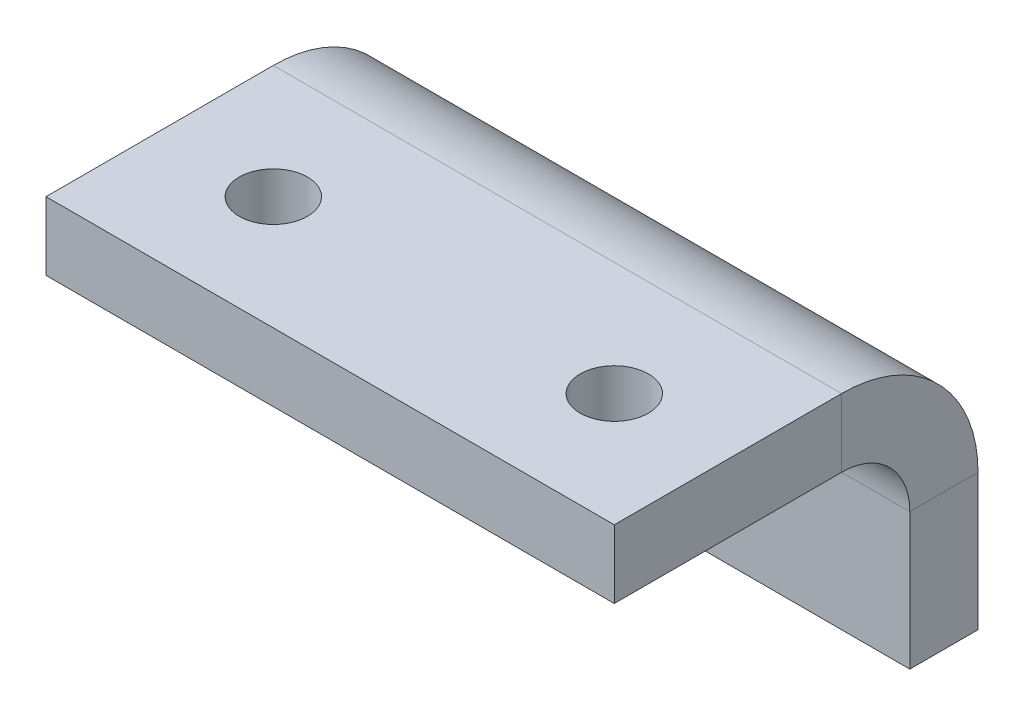
ISO-10303-21;
HEADER;
FILE_DESCRIPTION(('STEP AP214'),'2;1');
FILE_NAME('part.step','',(''),(''),'','','');
FILE_SCHEMA(('AUTOMOTIVE_DESIGN { 1 0 10303 214 1 1 1 1 }'));
ENDSEC;
DATA;
#1=APPLICATION_CONTEXT('core data for automotive mechanical design processes');
#2=APPLICATION_PROTOCOL_DEFINITION('international standard','automotive_design',2000,#1);
#3=PRODUCT_CONTEXT('',#1,'mechanical');
#4=PRODUCT('Part','Part','',(#3));
#5=PRODUCT_RELATED_PRODUCT_CATEGORY('part','',(#4));
#6=PRODUCT_DEFINITION_FORMATION('','',#4);
#7=PRODUCT_DEFINITION_CONTEXT('part definition',#1,'design');
#8=PRODUCT_DEFINITION('design','',#6,#7);
#9=PRODUCT_DEFINITION_SHAPE('','',#8);
#10=(LENGTH_UNIT() NAMED_UNIT(*) SI_UNIT(.MILLI.,.METRE.));
#11=(NAMED_UNIT(*) PLANE_ANGLE_UNIT() SI_UNIT($,.RADIAN.));
#12=(NAMED_UNIT(*) SI_UNIT($,.STERADIAN.) SOLID_ANGLE_UNIT());
#13=UNCERTAINTY_MEASURE_WITH_UNIT(LENGTH_MEASURE(1.E-05),#10,'distance_accuracy_value','');
#14=(GEOMETRIC_REPRESENTATION_CONTEXT(3) GLOBAL_UNCERTAINTY_ASSIGNED_CONTEXT((#13)) GLOBAL_UNIT_ASSIGNED_CONTEXT((#10,
#11,#12)) REPRESENTATION_CONTEXT('',''));
#15=CARTESIAN_POINT('',(0.,0.,0.));
#16=DIRECTION('',(0.,0.,1.));
#17=DIRECTION('',(1.,0.,0.));
#18=AXIS2_PLACEMENT_3D('',#15,#16,#17);
#19=CARTESIAN_POINT('',(0.,-3.,0.));
#20=DIRECTION('',(0.,0.,1.));
#21=DIRECTION('',(1.,0.,0.));
#22=AXIS2_PLACEMENT_3D('',#19,#20,#21);
#23=PLANE('',#22);
#24=DIRECTION('',(1.,0.,0.));
#25=VECTOR('',#24,1.);
#26=CARTESIAN_POINT('',(0.,0.,0.));
#27=LINE('',#26,#25);
#28=CARTESIAN_POINT('',(-25.,0.,0.));
#29=VERTEX_POINT('',#28);
#30=CARTESIAN_POINT('',(0.,0.,0.));
#31=VERTEX_POINT('',#30);
#32=EDGE_CURVE('E100',#29,#31,#27,.T.);
#33=ORIENTED_EDGE('',*,*,#32,.F.);
#34=DIRECTION('',(0.,1.,0.));
#35=VECTOR('',#34,1.);
#36=CARTESIAN_POINT('',(-25.,-3.,0.));
#37=LINE('',#36,#35);
#38=CARTESIAN_POINT('',(-25.,-3.,0.));
#39=VERTEX_POINT('',#38);
#40=EDGE_CURVE('E13',#39,#29,#37,.T.);
#41=ORIENTED_EDGE('',*,*,#40,.F.);
#42=DIRECTION('',(1.,0.,0.));
#43=VECTOR('',#42,1.);
#44=CARTESIAN_POINT('',(0.,-3.,0.));
#45=LINE('',#44,#43);
#46=CARTESIAN_POINT('',(0.,-3.,0.));
#47=VERTEX_POINT('',#46);
#48=EDGE_CURVE('E110',#39,#47,#45,.T.);
#49=ORIENTED_EDGE('',*,*,#48,.T.);
#50=DIRECTION('',(0.,1.,0.));
#51=VECTOR('',#50,1.);
#52=CARTESIAN_POINT('',(0.,-3.,0.));
#53=LINE('',#52,#51);
#54=EDGE_CURVE('E60',#47,#31,#53,.T.);
#55=ORIENTED_EDGE('',*,*,#54,.T.);
#56=EDGE_LOOP('',(#33,#41,#49,#55));
#57=FACE_BOUND('',#56,.T.);
#58=ADVANCED_FACE('F57',(#57),#23,.T.);
#59=CARTESIAN_POINT('',(-25.,-3.,0.));
#60=DIRECTION('',(-1.,0.,0.));
#61=DIRECTION('',(0.,0.,1.));
#62=AXIS2_PLACEMENT_3D('',#59,#60,#61);
#63=PLANE('',#62);
#64=DIRECTION('',(0.,0.,1.));
#65=VECTOR('',#64,1.);
#66=CARTESIAN_POINT('',(-25.,0.,0.));
#67=LINE('',#66,#65);
#68=CARTESIAN_POINT('',(-25.,0.,-10.));
#69=VERTEX_POINT('',#68);
#70=EDGE_CURVE('E96',#69,#29,#67,.T.);
#71=ORIENTED_EDGE('',*,*,#70,.F.);
#72=DIRECTION('',(0.,1.,0.));
#73=VECTOR('',#72,1.);
#74=CARTESIAN_POINT('',(-25.,-3.,-10.));
#75=LINE('',#74,#73);
#76=CARTESIAN_POINT('',(-25.,-3.00000000000001,-10.));
#77=VERTEX_POINT('',#76);
#78=EDGE_CURVE('E66',#77,#69,#75,.T.);
#79=ORIENTED_EDGE('',*,*,#78,.F.);
#80=DIRECTION('',(0.,0.,1.));
#81=VECTOR('',#80,1.);
#82=CARTESIAN_POINT('',(-25.,-3.,0.));
#83=LINE('',#82,#81);
#84=EDGE_CURVE('E98',#77,#39,#83,.T.);
#85=ORIENTED_EDGE('',*,*,#84,.T.);
#86=ORIENTED_EDGE('',*,*,#40,.T.);
#87=EDGE_LOOP('',(#71,#79,#85,#86));
#88=FACE_BOUND('',#87,.T.);
#89=ADVANCED_FACE('F93',(#88),#63,.T.);
#90=CARTESIAN_POINT('',(0.,-3.,0.));
#91=DIRECTION('',(1.,0.,0.));
#92=DIRECTION('',(0.,0.,-1.));
#93=AXIS2_PLACEMENT_3D('',#90,#91,#92);
#94=PLANE('',#93);
#95=DIRECTION('',(0.,0.,-1.));
#96=VECTOR('',#95,1.);
#97=CARTESIAN_POINT('',(0.,0.,0.));
#98=LINE('',#97,#96);
#99=CARTESIAN_POINT('',(0.,0.,-10.));
#100=VERTEX_POINT('',#99);
#101=EDGE_CURVE('E104',#31,#100,#98,.T.);
#102=ORIENTED_EDGE('',*,*,#101,.F.);
#103=ORIENTED_EDGE('',*,*,#54,.F.);
#104=DIRECTION('',(0.,0.,-1.));
#105=VECTOR('',#104,1.);
#106=CARTESIAN_POINT('',(0.,-3.,0.));
#107=LINE('',#106,#105);
#108=CARTESIAN_POINT('',(0.,-3.00000000000001,-10.));
#109=VERTEX_POINT('',#108);
#110=EDGE_CURVE('E112',#47,#109,#107,.T.);
#111=ORIENTED_EDGE('',*,*,#110,.T.);
#112=DIRECTION('',(0.,1.,0.));
#113=VECTOR('',#112,1.);
#114=CARTESIAN_POINT('',(0.,-3.,-10.));
#115=LINE('',#114,#113);
#116=EDGE_CURVE('E117',#109,#100,#115,.T.);
#117=ORIENTED_EDGE('',*,*,#116,.T.);
#118=EDGE_LOOP('',(#102,#103,#111,#117));
#119=FACE_BOUND('',#118,.T.);
#120=ADVANCED_FACE('F129',(#119),#94,.T.);
#121=CARTESIAN_POINT('',(0.,-3.,0.));
#122=DIRECTION('',(0.,-1.,0.));
#123=DIRECTION('',(0.,0.,-1.));
#124=AXIS2_PLACEMENT_3D('',#121,#122,#123);
#125=PLANE('',#124);
#126=CARTESIAN_POINT('',(-20.,-3.00000000000053,-5.));
#127=DIRECTION('',(0.,1.,0.));
#128=DIRECTION('',(0.,0.,1.));
#129=AXIS2_PLACEMENT_3D('',#126,#127,#128);
#130=CIRCLE('',#129,1.49999999999999);
#131=CARTESIAN_POINT('',(-20.,-3.00000000000053,-3.50000000000001));
#132=VERTEX_POINT('',#131);
#133=EDGE_CURVE('E141',#132,#132,#130,.T.);
#134=ORIENTED_EDGE('',*,*,#133,.T.);
#135=EDGE_LOOP('',(#134));
#136=FACE_BOUND('',#135,.T.);
#137=CARTESIAN_POINT('',(-5.,-3.00000000000053,-5.));
#138=DIRECTION('',(0.,1.,0.));
#139=DIRECTION('',(0.,0.,1.));
#140=AXIS2_PLACEMENT_3D('',#137,#138,#139);
#141=CIRCLE('',#140,1.49999999999999);
#142=CARTESIAN_POINT('',(-5.,-3.00000000000053,-3.50000000000001));
#143=VERTEX_POINT('',#142);
#144=EDGE_CURVE('E105',#143,#143,#141,.T.);
#145=ORIENTED_EDGE('',*,*,#144,.T.);
#146=EDGE_LOOP('',(#145));
#147=FACE_BOUND('',#146,.T.);
#148=ORIENTED_EDGE('',*,*,#48,.F.);
#149=ORIENTED_EDGE('',*,*,#84,.F.);
#150=DIRECTION('',(-1.,0.,0.));
#151=VECTOR('',#150,1.);
#152=CARTESIAN_POINT('',(0.,-3.,-10.));
#153=LINE('',#152,#151);
#154=EDGE_CURVE('E122',#109,#77,#153,.T.);
#155=ORIENTED_EDGE('',*,*,#154,.F.);
#156=ORIENTED_EDGE('',*,*,#110,.F.);
#157=EDGE_LOOP('',(#148,#149,#155,#156));
#158=FACE_BOUND('',#157,.T.);
#159=ADVANCED_FACE('F134',(#136,#147,#158),#125,.T.);
#160=CARTESIAN_POINT('',(0.,0.,0.));
#161=DIRECTION('',(0.,-1.,0.));
#162=DIRECTION('',(0.,0.,-1.));
#163=AXIS2_PLACEMENT_3D('',#160,#161,#162);
#164=PLANE('',#163);
#165=CARTESIAN_POINT('',(-20.,0.,-5.));
#166=DIRECTION('',(0.,1.,0.));
#167=DIRECTION('',(0.,0.,1.));
#168=AXIS2_PLACEMENT_3D('',#165,#166,#167);
#169=CIRCLE('',#168,1.49999999999999);
#170=CARTESIAN_POINT('',(-20.,0.,-3.50000000000001));
#171=VERTEX_POINT('',#170);
#172=EDGE_CURVE('E144',#171,#171,#169,.T.);
#173=ORIENTED_EDGE('',*,*,#172,.F.);
#174=EDGE_LOOP('',(#173));
#175=FACE_BOUND('',#174,.T.);
#176=CARTESIAN_POINT('',(-5.,0.,-5.));
#177=DIRECTION('',(0.,1.,0.));
#178=DIRECTION('',(0.,0.,1.));
#179=AXIS2_PLACEMENT_3D('',#176,#177,#178);
#180=CIRCLE('',#179,1.49999999999999);
#181=CARTESIAN_POINT('',(-5.,0.,-3.50000000000001));
#182=VERTEX_POINT('',#181);
#183=EDGE_CURVE('E138',#182,#182,#180,.T.);
#184=ORIENTED_EDGE('',*,*,#183,.F.);
#185=EDGE_LOOP('',(#184));
#186=FACE_BOUND('',#185,.T.);
#187=ORIENTED_EDGE('',*,*,#32,.T.);
#188=ORIENTED_EDGE('',*,*,#101,.T.);
#189=DIRECTION('',(-1.,0.,0.));
#190=VECTOR('',#189,1.);
#191=CARTESIAN_POINT('',(0.,0.,-10.));
#192=LINE('',#191,#190);
#193=EDGE_CURVE('E109',#100,#69,#192,.T.);
#194=ORIENTED_EDGE('',*,*,#193,.T.);
#195=ORIENTED_EDGE('',*,*,#70,.T.);
#196=EDGE_LOOP('',(#187,#188,#194,#195));
#197=FACE_BOUND('',#196,.T.);
#198=ADVANCED_FACE('F108',(#175,#186,#197),#164,.F.);
#199=CARTESIAN_POINT('',(-5.,0.,-5.));
#200=DIRECTION('',(0.,1.,0.));
#201=DIRECTION('',(0.,0.,1.));
#202=AXIS2_PLACEMENT_3D('',#199,#200,#201);
#203=CYLINDRICAL_SURFACE('',#202,1.49999999999999);
#204=ORIENTED_EDGE('',*,*,#144,.F.);
#205=EDGE_LOOP('',(#204));
#206=FACE_BOUND('',#205,.T.);
#207=ORIENTED_EDGE('',*,*,#183,.T.);
#208=EDGE_LOOP('',(#207));
#209=FACE_BOUND('',#208,.T.);
#210=ADVANCED_FACE('F248',(#206,#209),#203,.F.);
#211=CARTESIAN_POINT('',(-20.,0.,-5.));
#212=DIRECTION('',(0.,1.,0.));
#213=DIRECTION('',(0.,0.,1.));
#214=AXIS2_PLACEMENT_3D('',#211,#212,#213);
#215=CYLINDRICAL_SURFACE('',#214,1.49999999999999);
#216=ORIENTED_EDGE('',*,*,#133,.F.);
#217=EDGE_LOOP('',(#216));
#218=FACE_BOUND('',#217,.T.);
#219=ORIENTED_EDGE('',*,*,#172,.T.);
#220=EDGE_LOOP('',(#219));
#221=FACE_BOUND('',#220,.T.);
#222=ADVANCED_FACE('F241',(#218,#221),#215,.F.);
#223=CARTESIAN_POINT('',(-25.,-6.00000000000001,-10.));
#224=DIRECTION('',(-1.,0.,0.));
#225=DIRECTION('',(0.,0.,1.));
#226=AXIS2_PLACEMENT_3D('',#223,#224,#225);
#227=PLANE('',#226);
#228=DIRECTION('',(0.,0.,1.));
#229=VECTOR('',#228,1.);
#230=CARTESIAN_POINT('',(-25.,-5.99999999999997,-16.));
#231=LINE('',#230,#229);
#232=CARTESIAN_POINT('',(-25.,-6.,-13.));
#233=VERTEX_POINT('',#232);
#234=CARTESIAN_POINT('',(-25.,-5.99999999999999,-16.));
#235=VERTEX_POINT('',#234);
#236=EDGE_CURVE('E158',#233,#235,#231,.F.);
#237=ORIENTED_EDGE('',*,*,#236,.F.);
#238=CARTESIAN_POINT('',(-25.,-6.00000000000001,-10.));
#239=DIRECTION('',(1.,0.,0.));
#240=DIRECTION('',(0.,0.,-1.));
#241=AXIS2_PLACEMENT_3D('',#238,#239,#240);
#242=CIRCLE('',#241,3.);
#243=EDGE_CURVE('E150',#77,#233,#242,.F.);
#244=ORIENTED_EDGE('',*,*,#243,.F.);
#245=ORIENTED_EDGE('',*,*,#78,.T.);
#246=CARTESIAN_POINT('',(-25.,-6.00000000000001,-10.));
#247=DIRECTION('',(1.,0.,0.));
#248=DIRECTION('',(0.,0.,-1.));
#249=AXIS2_PLACEMENT_3D('',#246,#247,#248);
#250=CIRCLE('',#249,6.);
#251=EDGE_CURVE('E88',#69,#235,#250,.F.);
#252=ORIENTED_EDGE('',*,*,#251,.T.);
#253=EDGE_LOOP('',(#237,#244,#245,#252));
#254=FACE_BOUND('',#253,.T.);
#255=ADVANCED_FACE('F239',(#254),#227,.T.);
#256=CARTESIAN_POINT('',(0.,-6.00000000000001,-10.));
#257=DIRECTION('',(-1.,0.,0.));
#258=DIRECTION('',(0.,0.,1.));
#259=AXIS2_PLACEMENT_3D('',#256,#257,#258);
#260=PLANE('',#259);
#261=CARTESIAN_POINT('',(0.,-6.00000000000001,-10.));
#262=DIRECTION('',(1.,0.,0.));
#263=DIRECTION('',(0.,0.,-1.));
#264=AXIS2_PLACEMENT_3D('',#261,#262,#263);
#265=CIRCLE('',#264,3.);
#266=CARTESIAN_POINT('',(0.,-6.,-13.));
#267=VERTEX_POINT('',#266);
#268=EDGE_CURVE('E147',#267,#109,#265,.T.);
#269=ORIENTED_EDGE('',*,*,#268,.F.);
#270=DIRECTION('',(0.,0.,1.));
#271=VECTOR('',#270,1.);
#272=CARTESIAN_POINT('',(0.,-5.99999999999999,-13.));
#273=LINE('',#272,#271);
#274=CARTESIAN_POINT('',(0.,-5.99999999999997,-16.));
#275=VERTEX_POINT('',#274);
#276=EDGE_CURVE('E164',#267,#275,#273,.F.);
#277=ORIENTED_EDGE('',*,*,#276,.T.);
#278=CARTESIAN_POINT('',(0.,-6.00000000000001,-10.));
#279=DIRECTION('',(1.,0.,0.));
#280=DIRECTION('',(0.,0.,-1.));
#281=AXIS2_PLACEMENT_3D('',#278,#279,#280);
#282=CIRCLE('',#281,6.);
#283=EDGE_CURVE('E154',#275,#100,#282,.T.);
#284=ORIENTED_EDGE('',*,*,#283,.T.);
#285=ORIENTED_EDGE('',*,*,#116,.F.);
#286=EDGE_LOOP('',(#269,#277,#284,#285));
#287=FACE_BOUND('',#286,.T.);
#288=ADVANCED_FACE('F231',(#287),#260,.F.);
#289=CARTESIAN_POINT('',(0.,-6.00000000000001,-10.));
#290=DIRECTION('',(1.,0.,0.));
#291=DIRECTION('',(0.,0.,-1.));
#292=AXIS2_PLACEMENT_3D('',#289,#290,#291);
#293=CYLINDRICAL_SURFACE('',#292,6.);
#294=ORIENTED_EDGE('',*,*,#193,.F.);
#295=ORIENTED_EDGE('',*,*,#283,.F.);
#296=DIRECTION('',(1.,0.,0.));
#297=VECTOR('',#296,1.);
#298=CARTESIAN_POINT('',(-25.,-5.99999999999997,-16.));
#299=LINE('',#298,#297);
#300=EDGE_CURVE('E167',#275,#235,#299,.F.);
#301=ORIENTED_EDGE('',*,*,#300,.T.);
#302=ORIENTED_EDGE('',*,*,#251,.F.);
#303=EDGE_LOOP('',(#294,#295,#301,#302));
#304=FACE_BOUND('',#303,.T.);
#305=ADVANCED_FACE('F237',(#304),#293,.T.);
#306=CARTESIAN_POINT('',(0.,-6.00000000000001,-10.));
#307=DIRECTION('',(1.,0.,0.));
#308=DIRECTION('',(0.,0.,-1.));
#309=AXIS2_PLACEMENT_3D('',#306,#307,#308);
#310=CYLINDRICAL_SURFACE('',#309,3.);
#311=ORIENTED_EDGE('',*,*,#154,.T.);
#312=ORIENTED_EDGE('',*,*,#243,.T.);
#313=DIRECTION('',(1.,0.,0.));
#314=VECTOR('',#313,1.);
#315=CARTESIAN_POINT('',(-25.,-5.99999999999999,-13.));
#316=LINE('',#315,#314);
#317=EDGE_CURVE('E161',#233,#267,#316,.T.);
#318=ORIENTED_EDGE('',*,*,#317,.T.);
#319=ORIENTED_EDGE('',*,*,#268,.T.);
#320=EDGE_LOOP('',(#311,#312,#318,#319));
#321=FACE_BOUND('',#320,.T.);
#322=ADVANCED_FACE('F226',(#321),#310,.F.);
#323=CARTESIAN_POINT('',(0.,-12.,-16.));
#324=DIRECTION('',(-1.,0.,0.));
#325=DIRECTION('',(0.,-1.,0.));
#326=AXIS2_PLACEMENT_3D('',#323,#324,#325);
#327=PLANE('',#326);
#328=ORIENTED_EDGE('',*,*,#276,.F.);
#329=DIRECTION('',(0.,1.,0.));
#330=VECTOR('',#329,1.);
#331=CARTESIAN_POINT('',(0.,-12.,-13.));
#332=LINE('',#331,#330);
#333=CARTESIAN_POINT('',(0.,-12.,-13.));
#334=VERTEX_POINT('',#333);
#335=EDGE_CURVE('E169',#267,#334,#332,.F.);
#336=ORIENTED_EDGE('',*,*,#335,.T.);
#337=DIRECTION('',(0.,0.,1.));
#338=VECTOR('',#337,1.);
#339=CARTESIAN_POINT('',(0.,-12.,-16.));
#340=LINE('',#339,#338);
#341=CARTESIAN_POINT('',(0.,-12.,-16.));
#342=VERTEX_POINT('',#341);
#343=EDGE_CURVE('E151',#342,#334,#340,.T.);
#344=ORIENTED_EDGE('',*,*,#343,.F.);
#345=DIRECTION('',(0.,-1.,0.));
#346=VECTOR('',#345,1.);
#347=CARTESIAN_POINT('',(0.,0.,-16.));
#348=LINE('',#347,#346);
#349=EDGE_CURVE('E178',#275,#342,#348,.T.);
#350=ORIENTED_EDGE('',*,*,#349,.F.);
#351=EDGE_LOOP('',(#328,#336,#344,#350));
#352=FACE_BOUND('',#351,.T.);
#353=ADVANCED_FACE('F205',(#352),#327,.F.);
#354=CARTESIAN_POINT('',(-25.,-2.99999999999999,-16.));
#355=DIRECTION('',(1.,0.,0.));
#356=DIRECTION('',(0.,0.,-1.));
#357=AXIS2_PLACEMENT_3D('',#354,#355,#356);
#358=PLANE('',#357);
#359=ORIENTED_EDGE('',*,*,#236,.T.);
#360=DIRECTION('',(0.,1.,0.));
#361=VECTOR('',#360,1.);
#362=CARTESIAN_POINT('',(-25.,0.,-16.));
#363=LINE('',#362,#361);
#364=CARTESIAN_POINT('',(-25.,-12.,-16.));
#365=VERTEX_POINT('',#364);
#366=EDGE_CURVE('E184',#365,#235,#363,.T.);
#367=ORIENTED_EDGE('',*,*,#366,.F.);
#368=DIRECTION('',(0.,0.,1.));
#369=VECTOR('',#368,1.);
#370=CARTESIAN_POINT('',(-25.,-12.,-16.));
#371=LINE('',#370,#369);
#372=CARTESIAN_POINT('',(-25.,-12.,-13.));
#373=VERTEX_POINT('',#372);
#374=EDGE_CURVE('E187',#365,#373,#371,.T.);
#375=ORIENTED_EDGE('',*,*,#374,.T.);
#376=DIRECTION('',(0.,-1.,0.));
#377=VECTOR('',#376,1.);
#378=CARTESIAN_POINT('',(-25.,-3.,-13.));
#379=LINE('',#378,#377);
#380=EDGE_CURVE('E175',#373,#233,#379,.F.);
#381=ORIENTED_EDGE('',*,*,#380,.T.);
#382=EDGE_LOOP('',(#359,#367,#375,#381));
#383=FACE_BOUND('',#382,.T.);
#384=ADVANCED_FACE('F234',(#383),#358,.F.);
#385=CARTESIAN_POINT('',(0.,0.,-16.));
#386=DIRECTION('',(0.,0.,1.));
#387=DIRECTION('',(0.,-1.,0.));
#388=AXIS2_PLACEMENT_3D('',#385,#386,#387);
#389=PLANE('',#388);
#390=ORIENTED_EDGE('',*,*,#300,.F.);
#391=ORIENTED_EDGE('',*,*,#349,.T.);
#392=DIRECTION('',(-1.,0.,0.));
#393=VECTOR('',#392,1.);
#394=CARTESIAN_POINT('',(0.,-12.,-16.));
#395=LINE('',#394,#393);
#396=EDGE_CURVE('E181',#342,#365,#395,.T.);
#397=ORIENTED_EDGE('',*,*,#396,.T.);
#398=ORIENTED_EDGE('',*,*,#366,.T.);
#399=EDGE_LOOP('',(#390,#391,#397,#398));
#400=FACE_BOUND('',#399,.T.);
#401=ADVANCED_FACE('F236',(#400),#389,.F.);
#402=CARTESIAN_POINT('',(0.,0.,-13.));
#403=DIRECTION('',(0.,0.,1.));
#404=DIRECTION('',(0.,-1.,0.));
#405=AXIS2_PLACEMENT_3D('',#402,#403,#404);
#406=PLANE('',#405);
#407=ORIENTED_EDGE('',*,*,#335,.F.);
#408=ORIENTED_EDGE('',*,*,#317,.F.);
#409=ORIENTED_EDGE('',*,*,#380,.F.);
#410=DIRECTION('',(1.,0.,0.));
#411=VECTOR('',#410,1.);
#412=CARTESIAN_POINT('',(-25.,-12.,-13.));
#413=LINE('',#412,#411);
#414=EDGE_CURVE('E172',#334,#373,#413,.F.);
#415=ORIENTED_EDGE('',*,*,#414,.F.);
#416=EDGE_LOOP('',(#407,#408,#409,#415));
#417=FACE_BOUND('',#416,.T.);
#418=ADVANCED_FACE('F232',(#417),#406,.T.);
#419=CARTESIAN_POINT('',(-25.,-12.,-16.));
#420=DIRECTION('',(0.,1.,0.));
#421=DIRECTION('',(0.,0.,1.));
#422=AXIS2_PLACEMENT_3D('',#419,#420,#421);
#423=PLANE('',#422);
#424=ORIENTED_EDGE('',*,*,#414,.T.);
#425=ORIENTED_EDGE('',*,*,#374,.F.);
#426=ORIENTED_EDGE('',*,*,#396,.F.);
#427=ORIENTED_EDGE('',*,*,#343,.T.);
#428=EDGE_LOOP('',(#424,#425,#426,#427));
#429=FACE_BOUND('',#428,.T.);
#430=ADVANCED_FACE('F195',(#429),#423,.F.);
#431=CLOSED_SHELL('',(#58,#89,#120,#159,#198,#210,#222,#255,#288,#305,#322,#353,#384,#401,#418,#430));
#432=MANIFOLD_SOLID_BREP('B2',#431);
#433=ADVANCED_BREP_SHAPE_REPRESENTATION('',(#18,#432),#14);
#434=SHAPE_DEFINITION_REPRESENTATION(#9,#433);
ENDSEC;
END-ISO-10303-21;
